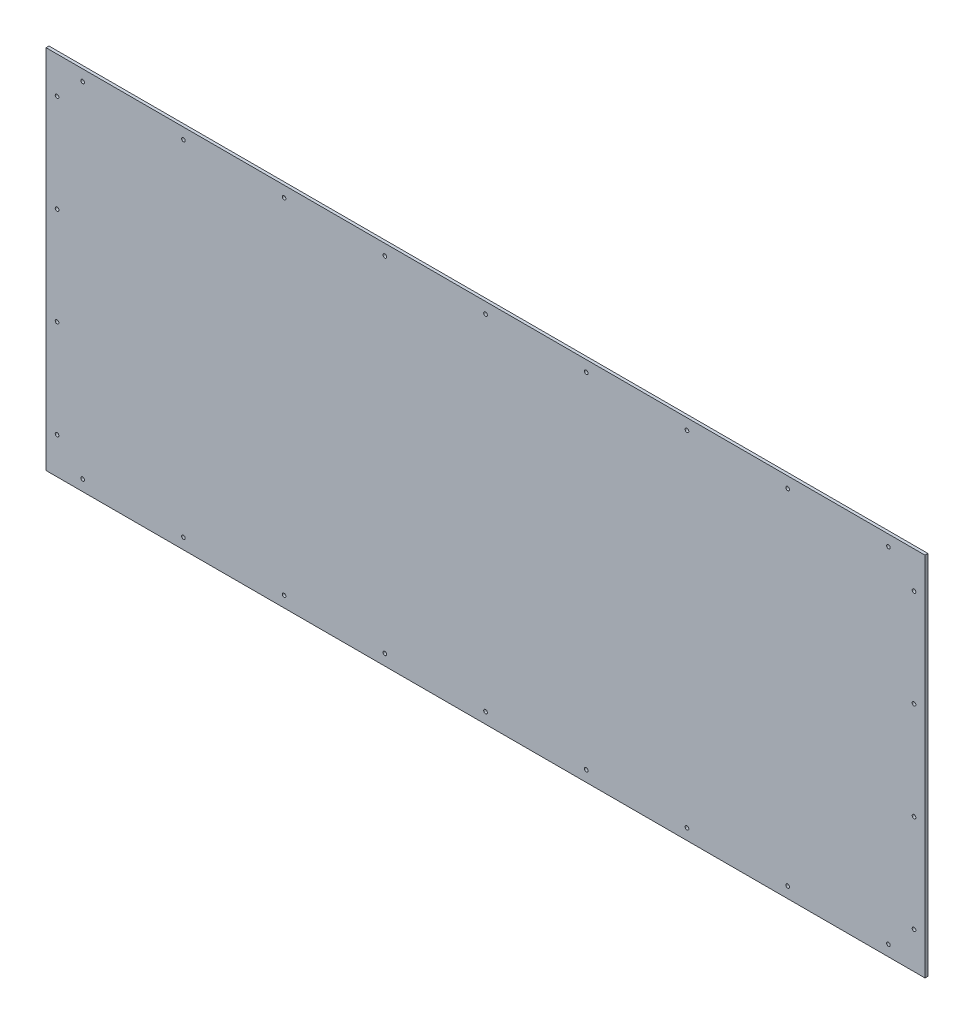
ISO-10303-21;
HEADER;
FILE_DESCRIPTION(('STEP AP214'),'2;1');
FILE_NAME('part.step','',(''),(''),'','','');
FILE_SCHEMA(('AUTOMOTIVE_DESIGN { 1 0 10303 214 1 1 1 1 }'));
ENDSEC;
DATA;
#1=APPLICATION_CONTEXT('core data for automotive mechanical design processes');
#2=APPLICATION_PROTOCOL_DEFINITION('international standard','automotive_design',2000,#1);
#3=PRODUCT_CONTEXT('',#1,'mechanical');
#4=PRODUCT('Part','Part','',(#3));
#5=PRODUCT_RELATED_PRODUCT_CATEGORY('part','',(#4));
#6=PRODUCT_DEFINITION_FORMATION('','',#4);
#7=PRODUCT_DEFINITION_CONTEXT('part definition',#1,'design');
#8=PRODUCT_DEFINITION('design','',#6,#7);
#9=PRODUCT_DEFINITION_SHAPE('','',#8);
#10=(LENGTH_UNIT() NAMED_UNIT(*) SI_UNIT(.MILLI.,.METRE.));
#11=(NAMED_UNIT(*) PLANE_ANGLE_UNIT() SI_UNIT($,.RADIAN.));
#12=(NAMED_UNIT(*) SI_UNIT($,.STERADIAN.) SOLID_ANGLE_UNIT());
#13=UNCERTAINTY_MEASURE_WITH_UNIT(LENGTH_MEASURE(1.E-05),#10,'distance_accuracy_value','');
#14=(GEOMETRIC_REPRESENTATION_CONTEXT(3) GLOBAL_UNCERTAINTY_ASSIGNED_CONTEXT((#13)) GLOBAL_UNIT_ASSIGNED_CONTEXT((#10,
#11,#12)) REPRESENTATION_CONTEXT('',''));
#15=CARTESIAN_POINT('',(0.,0.,0.));
#16=DIRECTION('',(0.,0.,1.));
#17=DIRECTION('',(1.,0.,0.));
#18=AXIS2_PLACEMENT_3D('',#15,#16,#17);
#19=CARTESIAN_POINT('',(300.,-125.,2.));
#20=DIRECTION('',(-1.,0.,0.));
#21=DIRECTION('',(0.,0.,1.));
#22=AXIS2_PLACEMENT_3D('',#19,#20,#21);
#23=PLANE('',#22);
#24=DIRECTION('',(0.,1.,0.));
#25=VECTOR('',#24,1.);
#26=CARTESIAN_POINT('',(300.,-125.,0.));
#27=LINE('',#26,#25);
#28=CARTESIAN_POINT('',(300.,-125.,0.));
#29=VERTEX_POINT('',#28);
#30=CARTESIAN_POINT('',(300.,125.,0.));
#31=VERTEX_POINT('',#30);
#32=EDGE_CURVE('E97',#29,#31,#27,.T.);
#33=ORIENTED_EDGE('',*,*,#32,.T.);
#34=DIRECTION('',(0.,0.,-1.));
#35=VECTOR('',#34,1.);
#36=CARTESIAN_POINT('',(300.,125.,2.));
#37=LINE('',#36,#35);
#38=CARTESIAN_POINT('',(300.,125.,2.));
#39=VERTEX_POINT('',#38);
#40=EDGE_CURVE('E11',#39,#31,#37,.T.);
#41=ORIENTED_EDGE('',*,*,#40,.F.);
#42=DIRECTION('',(0.,1.,0.));
#43=VECTOR('',#42,1.);
#44=CARTESIAN_POINT('',(300.,-125.,2.));
#45=LINE('',#44,#43);
#46=CARTESIAN_POINT('',(300.,-125.,2.));
#47=VERTEX_POINT('',#46);
#48=EDGE_CURVE('E85',#47,#39,#45,.T.);
#49=ORIENTED_EDGE('',*,*,#48,.F.);
#50=DIRECTION('',(0.,0.,-1.));
#51=VECTOR('',#50,1.);
#52=CARTESIAN_POINT('',(300.,-125.,2.));
#53=LINE('',#52,#51);
#54=EDGE_CURVE('E93',#47,#29,#53,.T.);
#55=ORIENTED_EDGE('',*,*,#54,.T.);
#56=EDGE_LOOP('',(#33,#41,#49,#55));
#57=FACE_BOUND('',#56,.T.);
#58=ADVANCED_FACE('F34',(#57),#23,.F.);
#59=CARTESIAN_POINT('',(-300.,125.,2.));
#60=DIRECTION('',(0.,-1.,0.));
#61=DIRECTION('',(0.,0.,-1.));
#62=AXIS2_PLACEMENT_3D('',#59,#60,#61);
#63=PLANE('',#62);
#64=DIRECTION('',(-1.,0.,0.));
#65=VECTOR('',#64,1.);
#66=CARTESIAN_POINT('',(-300.,125.,0.));
#67=LINE('',#66,#65);
#68=CARTESIAN_POINT('',(-300.,125.,0.));
#69=VERTEX_POINT('',#68);
#70=EDGE_CURVE('E89',#31,#69,#67,.T.);
#71=ORIENTED_EDGE('',*,*,#70,.T.);
#72=DIRECTION('',(0.,0.,-1.));
#73=VECTOR('',#72,1.);
#74=CARTESIAN_POINT('',(-300.,125.,2.));
#75=LINE('',#74,#73);
#76=CARTESIAN_POINT('',(-300.,125.,2.));
#77=VERTEX_POINT('',#76);
#78=EDGE_CURVE('E42',#77,#69,#75,.T.);
#79=ORIENTED_EDGE('',*,*,#78,.F.);
#80=DIRECTION('',(-1.,0.,0.));
#81=VECTOR('',#80,1.);
#82=CARTESIAN_POINT('',(-300.,125.,2.));
#83=LINE('',#82,#81);
#84=EDGE_CURVE('E80',#39,#77,#83,.T.);
#85=ORIENTED_EDGE('',*,*,#84,.F.);
#86=ORIENTED_EDGE('',*,*,#40,.T.);
#87=EDGE_LOOP('',(#71,#79,#85,#86));
#88=FACE_BOUND('',#87,.T.);
#89=ADVANCED_FACE('F88',(#88),#63,.F.);
#90=CARTESIAN_POINT('',(-300.,-125.,2.));
#91=DIRECTION('',(1.,0.,0.));
#92=DIRECTION('',(0.,0.,-1.));
#93=AXIS2_PLACEMENT_3D('',#90,#91,#92);
#94=PLANE('',#93);
#95=DIRECTION('',(0.,-1.,0.));
#96=VECTOR('',#95,1.);
#97=CARTESIAN_POINT('',(-300.,-125.,0.));
#98=LINE('',#97,#96);
#99=CARTESIAN_POINT('',(-300.,-125.,0.));
#100=VERTEX_POINT('',#99);
#101=EDGE_CURVE('E67',#69,#100,#98,.T.);
#102=ORIENTED_EDGE('',*,*,#101,.T.);
#103=DIRECTION('',(0.,0.,-1.));
#104=VECTOR('',#103,1.);
#105=CARTESIAN_POINT('',(-300.,-125.,2.));
#106=LINE('',#105,#104);
#107=CARTESIAN_POINT('',(-300.,-125.,2.));
#108=VERTEX_POINT('',#107);
#109=EDGE_CURVE('E90',#108,#100,#106,.T.);
#110=ORIENTED_EDGE('',*,*,#109,.F.);
#111=DIRECTION('',(0.,-1.,0.));
#112=VECTOR('',#111,1.);
#113=CARTESIAN_POINT('',(-300.,-125.,2.));
#114=LINE('',#113,#112);
#115=EDGE_CURVE('E83',#77,#108,#114,.T.);
#116=ORIENTED_EDGE('',*,*,#115,.F.);
#117=ORIENTED_EDGE('',*,*,#78,.T.);
#118=EDGE_LOOP('',(#102,#110,#116,#117));
#119=FACE_BOUND('',#118,.T.);
#120=ADVANCED_FACE('F91',(#119),#94,.F.);
#121=CARTESIAN_POINT('',(-300.,-125.,2.));
#122=DIRECTION('',(0.,1.,0.));
#123=DIRECTION('',(0.,0.,1.));
#124=AXIS2_PLACEMENT_3D('',#121,#122,#123);
#125=PLANE('',#124);
#126=DIRECTION('',(1.,0.,0.));
#127=VECTOR('',#126,1.);
#128=CARTESIAN_POINT('',(-300.,-125.,0.));
#129=LINE('',#128,#127);
#130=EDGE_CURVE('E73',#100,#29,#129,.T.);
#131=ORIENTED_EDGE('',*,*,#130,.T.);
#132=ORIENTED_EDGE('',*,*,#54,.F.);
#133=DIRECTION('',(1.,0.,0.));
#134=VECTOR('',#133,1.);
#135=CARTESIAN_POINT('',(-300.,-125.,2.));
#136=LINE('',#135,#134);
#137=EDGE_CURVE('E50',#108,#47,#136,.T.);
#138=ORIENTED_EDGE('',*,*,#137,.F.);
#139=ORIENTED_EDGE('',*,*,#109,.T.);
#140=EDGE_LOOP('',(#131,#132,#138,#139));
#141=FACE_BOUND('',#140,.T.);
#142=ADVANCED_FACE('F105',(#141),#125,.F.);
#143=CARTESIAN_POINT('',(0.,0.,2.));
#144=DIRECTION('',(0.,0.,-1.));
#145=DIRECTION('',(-1.,0.,0.));
#146=AXIS2_PLACEMENT_3D('',#143,#144,#145);
#147=PLANE('',#146);
#148=CARTESIAN_POINT('',(-275.,-117.5,2.));
#149=DIRECTION('',(0.,0.,1.));
#150=DIRECTION('',(-1.,0.,0.));
#151=AXIS2_PLACEMENT_3D('',#148,#149,#150);
#152=CIRCLE('',#151,1.25000000000006);
#153=CARTESIAN_POINT('',(-276.25,-117.5,2.));
#154=VERTEX_POINT('',#153);
#155=EDGE_CURVE('E120',#154,#154,#152,.T.);
#156=ORIENTED_EDGE('',*,*,#155,.F.);
#157=EDGE_LOOP('',(#156));
#158=FACE_BOUND('',#157,.T.);
#159=CARTESIAN_POINT('',(137.5,-117.5,2.));
#160=DIRECTION('',(0.,0.,1.));
#161=DIRECTION('',(1.,0.,0.));
#162=AXIS2_PLACEMENT_3D('',#159,#160,#161);
#163=CIRCLE('',#162,1.25000000000001);
#164=CARTESIAN_POINT('',(138.75,-117.5,2.));
#165=VERTEX_POINT('',#164);
#166=EDGE_CURVE('E141',#165,#165,#163,.T.);
#167=ORIENTED_EDGE('',*,*,#166,.F.);
#168=EDGE_LOOP('',(#167));
#169=FACE_BOUND('',#168,.T.);
#170=CARTESIAN_POINT('',(206.25,-117.5,2.));
#171=DIRECTION('',(0.,0.,1.));
#172=DIRECTION('',(1.,0.,0.));
#173=AXIS2_PLACEMENT_3D('',#170,#171,#172);
#174=CIRCLE('',#173,1.25000000000001);
#175=CARTESIAN_POINT('',(207.5,-117.5,2.));
#176=VERTEX_POINT('',#175);
#177=EDGE_CURVE('E128',#176,#176,#174,.T.);
#178=ORIENTED_EDGE('',*,*,#177,.F.);
#179=EDGE_LOOP('',(#178));
#180=FACE_BOUND('',#179,.T.);
#181=CARTESIAN_POINT('',(275.,-117.5,2.));
#182=DIRECTION('',(0.,0.,1.));
#183=DIRECTION('',(1.,0.,0.));
#184=AXIS2_PLACEMENT_3D('',#181,#182,#183);
#185=CIRCLE('',#184,1.24999999999996);
#186=CARTESIAN_POINT('',(276.25,-117.5,2.));
#187=VERTEX_POINT('',#186);
#188=EDGE_CURVE('E127',#187,#187,#185,.T.);
#189=ORIENTED_EDGE('',*,*,#188,.F.);
#190=EDGE_LOOP('',(#189));
#191=FACE_BOUND('',#190,.T.);
#192=CARTESIAN_POINT('',(1.38777878078145E-13,-117.5,2.));
#193=DIRECTION('',(0.,0.,1.));
#194=DIRECTION('',(-1.,0.,0.));
#195=AXIS2_PLACEMENT_3D('',#192,#193,#194);
#196=CIRCLE('',#195,1.25);
#197=CARTESIAN_POINT('',(-1.24999999999987,-117.5,2.));
#198=VERTEX_POINT('',#197);
#199=EDGE_CURVE('E134',#198,#198,#196,.T.);
#200=ORIENTED_EDGE('',*,*,#199,.F.);
#201=EDGE_LOOP('',(#200));
#202=FACE_BOUND('',#201,.T.);
#203=CARTESIAN_POINT('',(68.7500000000001,-117.5,2.));
#204=DIRECTION('',(0.,0.,1.));
#205=DIRECTION('',(1.,0.,0.));
#206=AXIS2_PLACEMENT_3D('',#203,#204,#205);
#207=CIRCLE('',#206,1.25);
#208=CARTESIAN_POINT('',(70.0000000000001,-117.5,2.));
#209=VERTEX_POINT('',#208);
#210=EDGE_CURVE('E142',#209,#209,#207,.T.);
#211=ORIENTED_EDGE('',*,*,#210,.F.);
#212=EDGE_LOOP('',(#211));
#213=FACE_BOUND('',#212,.T.);
#214=CARTESIAN_POINT('',(-68.7499999999999,-117.5,2.));
#215=DIRECTION('',(0.,0.,1.));
#216=DIRECTION('',(-1.,0.,0.));
#217=AXIS2_PLACEMENT_3D('',#214,#215,#216);
#218=CIRCLE('',#217,1.25);
#219=CARTESIAN_POINT('',(-69.9999999999999,-117.5,2.));
#220=VERTEX_POINT('',#219);
#221=EDGE_CURVE('E164',#220,#220,#218,.T.);
#222=ORIENTED_EDGE('',*,*,#221,.F.);
#223=EDGE_LOOP('',(#222));
#224=FACE_BOUND('',#223,.T.);
#225=CARTESIAN_POINT('',(-137.5,-117.5,2.));
#226=DIRECTION('',(0.,0.,1.));
#227=DIRECTION('',(-1.,0.,0.));
#228=AXIS2_PLACEMENT_3D('',#225,#226,#227);
#229=CIRCLE('',#228,1.25000000000001);
#230=CARTESIAN_POINT('',(-138.75,-117.5,2.));
#231=VERTEX_POINT('',#230);
#232=EDGE_CURVE('E158',#231,#231,#229,.T.);
#233=ORIENTED_EDGE('',*,*,#232,.F.);
#234=EDGE_LOOP('',(#233));
#235=FACE_BOUND('',#234,.T.);
#236=CARTESIAN_POINT('',(-206.25,-117.5,2.));
#237=DIRECTION('',(0.,0.,1.));
#238=DIRECTION('',(-1.,0.,0.));
#239=AXIS2_PLACEMENT_3D('',#236,#237,#238);
#240=CIRCLE('',#239,1.25000000000001);
#241=CARTESIAN_POINT('',(-207.5,-117.5,2.));
#242=VERTEX_POINT('',#241);
#243=EDGE_CURVE('E152',#242,#242,#240,.T.);
#244=ORIENTED_EDGE('',*,*,#243,.F.);
#245=EDGE_LOOP('',(#244));
#246=FACE_BOUND('',#245,.T.);
#247=CARTESIAN_POINT('',(-275.,117.5,2.));
#248=DIRECTION('',(0.,0.,1.));
#249=DIRECTION('',(1.,0.,0.));
#250=AXIS2_PLACEMENT_3D('',#247,#248,#249);
#251=CIRCLE('',#250,1.25000000000006);
#252=CARTESIAN_POINT('',(-273.75,117.5,2.));
#253=VERTEX_POINT('',#252);
#254=EDGE_CURVE('E199',#253,#253,#251,.T.);
#255=ORIENTED_EDGE('',*,*,#254,.F.);
#256=EDGE_LOOP('',(#255));
#257=FACE_BOUND('',#256,.T.);
#258=CARTESIAN_POINT('',(292.5,99.9999999999993,2.));
#259=DIRECTION('',(0.,0.,1.));
#260=DIRECTION('',(-1.,0.,0.));
#261=AXIS2_PLACEMENT_3D('',#258,#259,#260);
#262=CIRCLE('',#261,1.24999999999996);
#263=CARTESIAN_POINT('',(291.25,99.9999999999993,2.));
#264=VERTEX_POINT('',#263);
#265=EDGE_CURVE('E206',#264,#264,#262,.T.);
#266=ORIENTED_EDGE('',*,*,#265,.F.);
#267=EDGE_LOOP('',(#266));
#268=FACE_BOUND('',#267,.T.);
#269=CARTESIAN_POINT('',(292.499999999999,-100.000000000001,2.));
#270=DIRECTION('',(0.,0.,1.));
#271=DIRECTION('',(1.,0.,0.));
#272=AXIS2_PLACEMENT_3D('',#269,#270,#271);
#273=CIRCLE('',#272,1.24999999999996);
#274=CARTESIAN_POINT('',(293.749999999999,-100.000000000001,2.));
#275=VERTEX_POINT('',#274);
#276=EDGE_CURVE('E212',#275,#275,#273,.T.);
#277=ORIENTED_EDGE('',*,*,#276,.F.);
#278=EDGE_LOOP('',(#277));
#279=FACE_BOUND('',#278,.T.);
#280=CARTESIAN_POINT('',(292.5,33.3333333333326,2.));
#281=DIRECTION('',(0.,0.,1.));
#282=DIRECTION('',(-1.,0.,0.));
#283=AXIS2_PLACEMENT_3D('',#280,#281,#282);
#284=CIRCLE('',#283,1.25000000000001);
#285=CARTESIAN_POINT('',(291.25,33.3333333333326,2.));
#286=VERTEX_POINT('',#285);
#287=EDGE_CURVE('E176',#286,#286,#284,.T.);
#288=ORIENTED_EDGE('',*,*,#287,.F.);
#289=EDGE_LOOP('',(#288));
#290=FACE_BOUND('',#289,.T.);
#291=CARTESIAN_POINT('',(292.499999999999,-33.333333333334,2.));
#292=DIRECTION('',(0.,0.,1.));
#293=DIRECTION('',(-1.,0.,0.));
#294=AXIS2_PLACEMENT_3D('',#291,#292,#293);
#295=CIRCLE('',#294,1.25000000000001);
#296=CARTESIAN_POINT('',(291.249999999999,-33.333333333334,2.));
#297=VERTEX_POINT('',#296);
#298=EDGE_CURVE('E175',#297,#297,#295,.T.);
#299=ORIENTED_EDGE('',*,*,#298,.F.);
#300=EDGE_LOOP('',(#299));
#301=FACE_BOUND('',#300,.T.);
#302=CARTESIAN_POINT('',(-292.5,-33.3333333333333,2.));
#303=DIRECTION('',(0.,0.,1.));
#304=DIRECTION('',(1.,0.,0.));
#305=AXIS2_PLACEMENT_3D('',#302,#303,#304);
#306=CIRCLE('',#305,1.25000000000001);
#307=CARTESIAN_POINT('',(-291.25,-33.3333333333333,2.));
#308=VERTEX_POINT('',#307);
#309=EDGE_CURVE('E182',#308,#308,#306,.T.);
#310=ORIENTED_EDGE('',*,*,#309,.F.);
#311=EDGE_LOOP('',(#310));
#312=FACE_BOUND('',#311,.T.);
#313=CARTESIAN_POINT('',(-292.5,33.3333333333333,2.));
#314=DIRECTION('',(0.,0.,1.));
#315=DIRECTION('',(1.,0.,0.));
#316=AXIS2_PLACEMENT_3D('',#313,#314,#315);
#317=CIRCLE('',#316,1.25000000000001);
#318=CARTESIAN_POINT('',(-291.25,33.3333333333333,2.));
#319=VERTEX_POINT('',#318);
#320=EDGE_CURVE('E188',#319,#319,#317,.T.);
#321=ORIENTED_EDGE('',*,*,#320,.F.);
#322=EDGE_LOOP('',(#321));
#323=FACE_BOUND('',#322,.T.);
#324=CARTESIAN_POINT('',(-292.5,100.,2.));
#325=DIRECTION('',(0.,0.,1.));
#326=DIRECTION('',(1.,0.,0.));
#327=AXIS2_PLACEMENT_3D('',#324,#325,#326);
#328=CIRCLE('',#327,1.24999999999996);
#329=CARTESIAN_POINT('',(-291.25,100.,2.));
#330=VERTEX_POINT('',#329);
#331=EDGE_CURVE('E114',#330,#330,#328,.T.);
#332=ORIENTED_EDGE('',*,*,#331,.F.);
#333=EDGE_LOOP('',(#332));
#334=FACE_BOUND('',#333,.T.);
#335=CARTESIAN_POINT('',(137.5,117.5,2.));
#336=DIRECTION('',(0.,0.,1.));
#337=DIRECTION('',(-1.,0.,0.));
#338=AXIS2_PLACEMENT_3D('',#335,#336,#337);
#339=CIRCLE('',#338,1.25000000000001);
#340=CARTESIAN_POINT('',(136.25,117.5,2.));
#341=VERTEX_POINT('',#340);
#342=EDGE_CURVE('E224',#341,#341,#339,.T.);
#343=ORIENTED_EDGE('',*,*,#342,.F.);
#344=EDGE_LOOP('',(#343));
#345=FACE_BOUND('',#344,.T.);
#346=CARTESIAN_POINT('',(206.25,117.5,2.));
#347=DIRECTION('',(0.,0.,1.));
#348=DIRECTION('',(-1.,0.,0.));
#349=AXIS2_PLACEMENT_3D('',#346,#347,#348);
#350=CIRCLE('',#349,1.25000000000001);
#351=CARTESIAN_POINT('',(205.,117.5,2.));
#352=VERTEX_POINT('',#351);
#353=EDGE_CURVE('E247',#352,#352,#350,.T.);
#354=ORIENTED_EDGE('',*,*,#353,.F.);
#355=EDGE_LOOP('',(#354));
#356=FACE_BOUND('',#355,.T.);
#357=CARTESIAN_POINT('',(275.,117.5,2.));
#358=DIRECTION('',(0.,0.,1.));
#359=DIRECTION('',(-1.,0.,0.));
#360=AXIS2_PLACEMENT_3D('',#357,#358,#359);
#361=CIRCLE('',#360,1.24999999999996);
#362=CARTESIAN_POINT('',(273.75,117.5,2.));
#363=VERTEX_POINT('',#362);
#364=EDGE_CURVE('E248',#363,#363,#361,.T.);
#365=ORIENTED_EDGE('',*,*,#364,.F.);
#366=EDGE_LOOP('',(#365));
#367=FACE_BOUND('',#366,.T.);
#368=CARTESIAN_POINT('',(1.38777878078145E-13,117.5,2.));
#369=DIRECTION('',(0.,0.,1.));
#370=DIRECTION('',(1.,0.,0.));
#371=AXIS2_PLACEMENT_3D('',#368,#369,#370);
#372=CIRCLE('',#371,1.25);
#373=CARTESIAN_POINT('',(1.25000000000014,117.5,2.));
#374=VERTEX_POINT('',#373);
#375=EDGE_CURVE('E258',#374,#374,#372,.T.);
#376=ORIENTED_EDGE('',*,*,#375,.F.);
#377=EDGE_LOOP('',(#376));
#378=FACE_BOUND('',#377,.T.);
#379=CARTESIAN_POINT('',(68.7500000000001,117.5,2.));
#380=DIRECTION('',(0.,0.,1.));
#381=DIRECTION('',(-1.,0.,0.));
#382=AXIS2_PLACEMENT_3D('',#379,#380,#381);
#383=CIRCLE('',#382,1.25);
#384=CARTESIAN_POINT('',(67.5000000000001,117.5,2.));
#385=VERTEX_POINT('',#384);
#386=EDGE_CURVE('E223',#385,#385,#383,.T.);
#387=ORIENTED_EDGE('',*,*,#386,.F.);
#388=EDGE_LOOP('',(#387));
#389=FACE_BOUND('',#388,.T.);
#390=CARTESIAN_POINT('',(-68.7499999999999,117.5,2.));
#391=DIRECTION('',(0.,0.,1.));
#392=DIRECTION('',(1.,0.,0.));
#393=AXIS2_PLACEMENT_3D('',#390,#391,#392);
#394=CIRCLE('',#393,1.25);
#395=CARTESIAN_POINT('',(-67.4999999999999,117.5,2.));
#396=VERTEX_POINT('',#395);
#397=EDGE_CURVE('E230',#396,#396,#394,.T.);
#398=ORIENTED_EDGE('',*,*,#397,.F.);
#399=EDGE_LOOP('',(#398));
#400=FACE_BOUND('',#399,.T.);
#401=CARTESIAN_POINT('',(-137.5,117.5,2.));
#402=DIRECTION('',(0.,0.,1.));
#403=DIRECTION('',(1.,0.,0.));
#404=AXIS2_PLACEMENT_3D('',#401,#402,#403);
#405=CIRCLE('',#404,1.25000000000001);
#406=CARTESIAN_POINT('',(-136.25,117.5,2.));
#407=VERTEX_POINT('',#406);
#408=EDGE_CURVE('E236',#407,#407,#405,.T.);
#409=ORIENTED_EDGE('',*,*,#408,.F.);
#410=EDGE_LOOP('',(#409));
#411=FACE_BOUND('',#410,.T.);
#412=CARTESIAN_POINT('',(-206.25,117.5,2.));
#413=DIRECTION('',(0.,0.,1.));
#414=DIRECTION('',(1.,0.,0.));
#415=AXIS2_PLACEMENT_3D('',#412,#413,#414);
#416=CIRCLE('',#415,1.25000000000001);
#417=CARTESIAN_POINT('',(-205.,117.5,2.));
#418=VERTEX_POINT('',#417);
#419=EDGE_CURVE('E200',#418,#418,#416,.T.);
#420=ORIENTED_EDGE('',*,*,#419,.F.);
#421=EDGE_LOOP('',(#420));
#422=FACE_BOUND('',#421,.T.);
#423=CARTESIAN_POINT('',(-292.5,-100.,2.));
#424=DIRECTION('',(0.,0.,1.));
#425=DIRECTION('',(-1.,0.,0.));
#426=AXIS2_PLACEMENT_3D('',#423,#424,#425);
#427=CIRCLE('',#426,1.24999999999996);
#428=CARTESIAN_POINT('',(-293.75,-100.,2.));
#429=VERTEX_POINT('',#428);
#430=EDGE_CURVE('E100',#429,#429,#427,.T.);
#431=ORIENTED_EDGE('',*,*,#430,.F.);
#432=EDGE_LOOP('',(#431));
#433=FACE_BOUND('',#432,.T.);
#434=ORIENTED_EDGE('',*,*,#48,.T.);
#435=ORIENTED_EDGE('',*,*,#84,.T.);
#436=ORIENTED_EDGE('',*,*,#115,.T.);
#437=ORIENTED_EDGE('',*,*,#137,.T.);
#438=EDGE_LOOP('',(#434,#435,#436,#437));
#439=FACE_BOUND('',#438,.T.);
#440=ADVANCED_FACE('F81',(#158,#169,#180,#191,#202,#213,#224,#235,#246,#257,#268,#279,#290,#301,
#312,#323,#334,#345,#356,#367,#378,#389,#400,#411,#422,#433,#439),#147,.F.);
#441=CARTESIAN_POINT('',(0.,0.,0.));
#442=DIRECTION('',(0.,0.,-1.));
#443=DIRECTION('',(-1.,0.,0.));
#444=AXIS2_PLACEMENT_3D('',#441,#442,#443);
#445=PLANE('',#444);
#446=CARTESIAN_POINT('',(-275.,-117.5,0.));
#447=DIRECTION('',(0.,0.,1.));
#448=DIRECTION('',(-1.,0.,0.));
#449=AXIS2_PLACEMENT_3D('',#446,#447,#448);
#450=CIRCLE('',#449,1.25000000000006);
#451=CARTESIAN_POINT('',(-276.25,-117.5,0.));
#452=VERTEX_POINT('',#451);
#453=EDGE_CURVE('E117',#452,#452,#450,.T.);
#454=ORIENTED_EDGE('',*,*,#453,.T.);
#455=EDGE_LOOP('',(#454));
#456=FACE_BOUND('',#455,.T.);
#457=CARTESIAN_POINT('',(137.5,-117.5,0.));
#458=DIRECTION('',(0.,0.,1.));
#459=DIRECTION('',(1.,0.,0.));
#460=AXIS2_PLACEMENT_3D('',#457,#458,#459);
#461=CIRCLE('',#460,1.25000000000001);
#462=CARTESIAN_POINT('',(138.75,-117.5,0.));
#463=VERTEX_POINT('',#462);
#464=EDGE_CURVE('E138',#463,#463,#461,.T.);
#465=ORIENTED_EDGE('',*,*,#464,.T.);
#466=EDGE_LOOP('',(#465));
#467=FACE_BOUND('',#466,.T.);
#468=CARTESIAN_POINT('',(206.25,-117.5,0.));
#469=DIRECTION('',(0.,0.,1.));
#470=DIRECTION('',(1.,0.,0.));
#471=AXIS2_PLACEMENT_3D('',#468,#469,#470);
#472=CIRCLE('',#471,1.25000000000001);
#473=CARTESIAN_POINT('',(207.5,-117.5,0.));
#474=VERTEX_POINT('',#473);
#475=EDGE_CURVE('E145',#474,#474,#472,.T.);
#476=ORIENTED_EDGE('',*,*,#475,.T.);
#477=EDGE_LOOP('',(#476));
#478=FACE_BOUND('',#477,.T.);
#479=CARTESIAN_POINT('',(275.,-117.5,0.));
#480=DIRECTION('',(0.,0.,1.));
#481=DIRECTION('',(1.,0.,0.));
#482=AXIS2_PLACEMENT_3D('',#479,#480,#481);
#483=CIRCLE('',#482,1.24999999999996);
#484=CARTESIAN_POINT('',(276.25,-117.5,0.));
#485=VERTEX_POINT('',#484);
#486=EDGE_CURVE('E124',#485,#485,#483,.T.);
#487=ORIENTED_EDGE('',*,*,#486,.T.);
#488=EDGE_LOOP('',(#487));
#489=FACE_BOUND('',#488,.T.);
#490=CARTESIAN_POINT('',(1.38777878078145E-13,-117.5,0.));
#491=DIRECTION('',(0.,0.,1.));
#492=DIRECTION('',(-1.,0.,0.));
#493=AXIS2_PLACEMENT_3D('',#490,#491,#492);
#494=CIRCLE('',#493,1.25);
#495=CARTESIAN_POINT('',(-1.24999999999987,-117.5,0.));
#496=VERTEX_POINT('',#495);
#497=EDGE_CURVE('E131',#496,#496,#494,.T.);
#498=ORIENTED_EDGE('',*,*,#497,.T.);
#499=EDGE_LOOP('',(#498));
#500=FACE_BOUND('',#499,.T.);
#501=CARTESIAN_POINT('',(68.7500000000001,-117.5,0.));
#502=DIRECTION('',(0.,0.,1.));
#503=DIRECTION('',(1.,0.,0.));
#504=AXIS2_PLACEMENT_3D('',#501,#502,#503);
#505=CIRCLE('',#504,1.25);
#506=CARTESIAN_POINT('',(70.0000000000001,-117.5,0.));
#507=VERTEX_POINT('',#506);
#508=EDGE_CURVE('E167',#507,#507,#505,.T.);
#509=ORIENTED_EDGE('',*,*,#508,.T.);
#510=EDGE_LOOP('',(#509));
#511=FACE_BOUND('',#510,.T.);
#512=CARTESIAN_POINT('',(-68.7499999999999,-117.5,0.));
#513=DIRECTION('',(0.,0.,1.));
#514=DIRECTION('',(-1.,0.,0.));
#515=AXIS2_PLACEMENT_3D('',#512,#513,#514);
#516=CIRCLE('',#515,1.25);
#517=CARTESIAN_POINT('',(-69.9999999999999,-117.5,0.));
#518=VERTEX_POINT('',#517);
#519=EDGE_CURVE('E161',#518,#518,#516,.T.);
#520=ORIENTED_EDGE('',*,*,#519,.T.);
#521=EDGE_LOOP('',(#520));
#522=FACE_BOUND('',#521,.T.);
#523=CARTESIAN_POINT('',(-137.5,-117.5,0.));
#524=DIRECTION('',(0.,0.,1.));
#525=DIRECTION('',(-1.,0.,0.));
#526=AXIS2_PLACEMENT_3D('',#523,#524,#525);
#527=CIRCLE('',#526,1.25000000000001);
#528=CARTESIAN_POINT('',(-138.75,-117.5,0.));
#529=VERTEX_POINT('',#528);
#530=EDGE_CURVE('E155',#529,#529,#527,.T.);
#531=ORIENTED_EDGE('',*,*,#530,.T.);
#532=EDGE_LOOP('',(#531));
#533=FACE_BOUND('',#532,.T.);
#534=CARTESIAN_POINT('',(-206.25,-117.5,0.));
#535=DIRECTION('',(0.,0.,1.));
#536=DIRECTION('',(-1.,0.,0.));
#537=AXIS2_PLACEMENT_3D('',#534,#535,#536);
#538=CIRCLE('',#537,1.25000000000001);
#539=CARTESIAN_POINT('',(-207.5,-117.5,0.));
#540=VERTEX_POINT('',#539);
#541=EDGE_CURVE('E123',#540,#540,#538,.T.);
#542=ORIENTED_EDGE('',*,*,#541,.T.);
#543=EDGE_LOOP('',(#542));
#544=FACE_BOUND('',#543,.T.);
#545=CARTESIAN_POINT('',(-275.,117.5,0.));
#546=DIRECTION('',(0.,0.,1.));
#547=DIRECTION('',(1.,0.,0.));
#548=AXIS2_PLACEMENT_3D('',#545,#546,#547);
#549=CIRCLE('',#548,1.25000000000006);
#550=CARTESIAN_POINT('',(-273.75,117.5,0.));
#551=VERTEX_POINT('',#550);
#552=EDGE_CURVE('E196',#551,#551,#549,.T.);
#553=ORIENTED_EDGE('',*,*,#552,.T.);
#554=EDGE_LOOP('',(#553));
#555=FACE_BOUND('',#554,.T.);
#556=CARTESIAN_POINT('',(292.5,99.9999999999993,0.));
#557=DIRECTION('',(0.,0.,1.));
#558=DIRECTION('',(-1.,0.,0.));
#559=AXIS2_PLACEMENT_3D('',#556,#557,#558);
#560=CIRCLE('',#559,1.24999999999996);
#561=CARTESIAN_POINT('',(291.25,99.9999999999993,0.));
#562=VERTEX_POINT('',#561);
#563=EDGE_CURVE('E203',#562,#562,#560,.T.);
#564=ORIENTED_EDGE('',*,*,#563,.T.);
#565=EDGE_LOOP('',(#564));
#566=FACE_BOUND('',#565,.T.);
#567=CARTESIAN_POINT('',(292.499999999999,-100.000000000001,0.));
#568=DIRECTION('',(0.,0.,1.));
#569=DIRECTION('',(1.,0.,0.));
#570=AXIS2_PLACEMENT_3D('',#567,#568,#569);
#571=CIRCLE('',#570,1.24999999999996);
#572=CARTESIAN_POINT('',(293.749999999999,-100.000000000001,0.));
#573=VERTEX_POINT('',#572);
#574=EDGE_CURVE('E209',#573,#573,#571,.T.);
#575=ORIENTED_EDGE('',*,*,#574,.T.);
#576=EDGE_LOOP('',(#575));
#577=FACE_BOUND('',#576,.T.);
#578=CARTESIAN_POINT('',(292.5,33.3333333333326,0.));
#579=DIRECTION('',(0.,0.,1.));
#580=DIRECTION('',(-1.,0.,0.));
#581=AXIS2_PLACEMENT_3D('',#578,#579,#580);
#582=CIRCLE('',#581,1.25000000000001);
#583=CARTESIAN_POINT('',(291.25,33.3333333333326,0.));
#584=VERTEX_POINT('',#583);
#585=EDGE_CURVE('E215',#584,#584,#582,.T.);
#586=ORIENTED_EDGE('',*,*,#585,.T.);
#587=EDGE_LOOP('',(#586));
#588=FACE_BOUND('',#587,.T.);
#589=CARTESIAN_POINT('',(292.499999999999,-33.333333333334,0.));
#590=DIRECTION('',(0.,0.,1.));
#591=DIRECTION('',(-1.,0.,0.));
#592=AXIS2_PLACEMENT_3D('',#589,#590,#591);
#593=CIRCLE('',#592,1.25000000000001);
#594=CARTESIAN_POINT('',(291.249999999999,-33.333333333334,0.));
#595=VERTEX_POINT('',#594);
#596=EDGE_CURVE('E172',#595,#595,#593,.T.);
#597=ORIENTED_EDGE('',*,*,#596,.T.);
#598=EDGE_LOOP('',(#597));
#599=FACE_BOUND('',#598,.T.);
#600=CARTESIAN_POINT('',(-292.5,-33.3333333333333,0.));
#601=DIRECTION('',(0.,0.,1.));
#602=DIRECTION('',(1.,0.,0.));
#603=AXIS2_PLACEMENT_3D('',#600,#601,#602);
#604=CIRCLE('',#603,1.25000000000001);
#605=CARTESIAN_POINT('',(-291.25,-33.3333333333333,0.));
#606=VERTEX_POINT('',#605);
#607=EDGE_CURVE('E179',#606,#606,#604,.T.);
#608=ORIENTED_EDGE('',*,*,#607,.T.);
#609=EDGE_LOOP('',(#608));
#610=FACE_BOUND('',#609,.T.);
#611=CARTESIAN_POINT('',(-292.5,33.3333333333333,0.));
#612=DIRECTION('',(0.,0.,1.));
#613=DIRECTION('',(1.,0.,0.));
#614=AXIS2_PLACEMENT_3D('',#611,#612,#613);
#615=CIRCLE('',#614,1.25000000000001);
#616=CARTESIAN_POINT('',(-291.25,33.3333333333333,0.));
#617=VERTEX_POINT('',#616);
#618=EDGE_CURVE('E185',#617,#617,#615,.T.);
#619=ORIENTED_EDGE('',*,*,#618,.T.);
#620=EDGE_LOOP('',(#619));
#621=FACE_BOUND('',#620,.T.);
#622=CARTESIAN_POINT('',(-292.5,100.,0.));
#623=DIRECTION('',(0.,0.,1.));
#624=DIRECTION('',(1.,0.,0.));
#625=AXIS2_PLACEMENT_3D('',#622,#623,#624);
#626=CIRCLE('',#625,1.24999999999996);
#627=CARTESIAN_POINT('',(-291.25,100.,0.));
#628=VERTEX_POINT('',#627);
#629=EDGE_CURVE('E191',#628,#628,#626,.T.);
#630=ORIENTED_EDGE('',*,*,#629,.T.);
#631=EDGE_LOOP('',(#630));
#632=FACE_BOUND('',#631,.T.);
#633=CARTESIAN_POINT('',(137.5,117.5,0.));
#634=DIRECTION('',(0.,0.,1.));
#635=DIRECTION('',(-1.,0.,0.));
#636=AXIS2_PLACEMENT_3D('',#633,#634,#635);
#637=CIRCLE('',#636,1.25000000000001);
#638=CARTESIAN_POINT('',(136.25,117.5,0.));
#639=VERTEX_POINT('',#638);
#640=EDGE_CURVE('E251',#639,#639,#637,.T.);
#641=ORIENTED_EDGE('',*,*,#640,.T.);
#642=EDGE_LOOP('',(#641));
#643=FACE_BOUND('',#642,.T.);
#644=CARTESIAN_POINT('',(206.25,117.5,0.));
#645=DIRECTION('',(0.,0.,1.));
#646=DIRECTION('',(-1.,0.,0.));
#647=AXIS2_PLACEMENT_3D('',#644,#645,#646);
#648=CIRCLE('',#647,1.25000000000001);
#649=CARTESIAN_POINT('',(205.,117.5,0.));
#650=VERTEX_POINT('',#649);
#651=EDGE_CURVE('E244',#650,#650,#648,.T.);
#652=ORIENTED_EDGE('',*,*,#651,.T.);
#653=EDGE_LOOP('',(#652));
#654=FACE_BOUND('',#653,.T.);
#655=CARTESIAN_POINT('',(275.,117.5,0.));
#656=DIRECTION('',(0.,0.,1.));
#657=DIRECTION('',(-1.,0.,0.));
#658=AXIS2_PLACEMENT_3D('',#655,#656,#657);
#659=CIRCLE('',#658,1.24999999999996);
#660=CARTESIAN_POINT('',(273.75,117.5,0.));
#661=VERTEX_POINT('',#660);
#662=EDGE_CURVE('E261',#661,#661,#659,.T.);
#663=ORIENTED_EDGE('',*,*,#662,.T.);
#664=EDGE_LOOP('',(#663));
#665=FACE_BOUND('',#664,.T.);
#666=CARTESIAN_POINT('',(1.38777878078145E-13,117.5,0.));
#667=DIRECTION('',(0.,0.,1.));
#668=DIRECTION('',(1.,0.,0.));
#669=AXIS2_PLACEMENT_3D('',#666,#667,#668);
#670=CIRCLE('',#669,1.25);
#671=CARTESIAN_POINT('',(1.25000000000014,117.5,0.));
#672=VERTEX_POINT('',#671);
#673=EDGE_CURVE('E137',#672,#672,#670,.T.);
#674=ORIENTED_EDGE('',*,*,#673,.T.);
#675=EDGE_LOOP('',(#674));
#676=FACE_BOUND('',#675,.T.);
#677=CARTESIAN_POINT('',(68.7500000000001,117.5,0.));
#678=DIRECTION('',(0.,0.,1.));
#679=DIRECTION('',(-1.,0.,0.));
#680=AXIS2_PLACEMENT_3D('',#677,#678,#679);
#681=CIRCLE('',#680,1.25);
#682=CARTESIAN_POINT('',(67.5000000000001,117.5,0.));
#683=VERTEX_POINT('',#682);
#684=EDGE_CURVE('E220',#683,#683,#681,.T.);
#685=ORIENTED_EDGE('',*,*,#684,.T.);
#686=EDGE_LOOP('',(#685));
#687=FACE_BOUND('',#686,.T.);
#688=CARTESIAN_POINT('',(-68.7499999999999,117.5,0.));
#689=DIRECTION('',(0.,0.,1.));
#690=DIRECTION('',(1.,0.,0.));
#691=AXIS2_PLACEMENT_3D('',#688,#689,#690);
#692=CIRCLE('',#691,1.25);
#693=CARTESIAN_POINT('',(-67.4999999999999,117.5,0.));
#694=VERTEX_POINT('',#693);
#695=EDGE_CURVE('E227',#694,#694,#692,.T.);
#696=ORIENTED_EDGE('',*,*,#695,.T.);
#697=EDGE_LOOP('',(#696));
#698=FACE_BOUND('',#697,.T.);
#699=CARTESIAN_POINT('',(-137.5,117.5,0.));
#700=DIRECTION('',(0.,0.,1.));
#701=DIRECTION('',(1.,0.,0.));
#702=AXIS2_PLACEMENT_3D('',#699,#700,#701);
#703=CIRCLE('',#702,1.25000000000001);
#704=CARTESIAN_POINT('',(-136.25,117.5,0.));
#705=VERTEX_POINT('',#704);
#706=EDGE_CURVE('E233',#705,#705,#703,.T.);
#707=ORIENTED_EDGE('',*,*,#706,.T.);
#708=EDGE_LOOP('',(#707));
#709=FACE_BOUND('',#708,.T.);
#710=CARTESIAN_POINT('',(-206.25,117.5,0.));
#711=DIRECTION('',(0.,0.,1.));
#712=DIRECTION('',(1.,0.,0.));
#713=AXIS2_PLACEMENT_3D('',#710,#711,#712);
#714=CIRCLE('',#713,1.25000000000001);
#715=CARTESIAN_POINT('',(-205.,117.5,0.));
#716=VERTEX_POINT('',#715);
#717=EDGE_CURVE('E239',#716,#716,#714,.T.);
#718=ORIENTED_EDGE('',*,*,#717,.T.);
#719=EDGE_LOOP('',(#718));
#720=FACE_BOUND('',#719,.T.);
#721=CARTESIAN_POINT('',(-292.5,-100.,0.));
#722=DIRECTION('',(0.,0.,1.));
#723=DIRECTION('',(-1.,0.,0.));
#724=AXIS2_PLACEMENT_3D('',#721,#722,#723);
#725=CIRCLE('',#724,1.24999999999996);
#726=CARTESIAN_POINT('',(-293.75,-100.,0.));
#727=VERTEX_POINT('',#726);
#728=EDGE_CURVE('E111',#727,#727,#725,.T.);
#729=ORIENTED_EDGE('',*,*,#728,.T.);
#730=EDGE_LOOP('',(#729));
#731=FACE_BOUND('',#730,.T.);
#732=ORIENTED_EDGE('',*,*,#32,.F.);
#733=ORIENTED_EDGE('',*,*,#130,.F.);
#734=ORIENTED_EDGE('',*,*,#101,.F.);
#735=ORIENTED_EDGE('',*,*,#70,.F.);
#736=EDGE_LOOP('',(#732,#733,#734,#735));
#737=FACE_BOUND('',#736,.T.);
#738=ADVANCED_FACE('F108',(#456,#467,#478,#489,#500,#511,#522,#533,#544,#555,#566,#577,#588,
#599,#610,#621,#632,#643,#654,#665,#676,#687,#698,#709,#720,#731,#737),#445,.T.);
#739=CARTESIAN_POINT('',(-292.5,-100.,2.));
#740=DIRECTION('',(0.,0.,-1.));
#741=DIRECTION('',(-1.,0.,0.));
#742=AXIS2_PLACEMENT_3D('',#739,#740,#741);
#743=CYLINDRICAL_SURFACE('',#742,1.24999999999996);
#744=ORIENTED_EDGE('',*,*,#430,.T.);
#745=EDGE_LOOP('',(#744));
#746=FACE_BOUND('',#745,.T.);
#747=ORIENTED_EDGE('',*,*,#728,.F.);
#748=EDGE_LOOP('',(#747));
#749=FACE_BOUND('',#748,.T.);
#750=ADVANCED_FACE('F286',(#746,#749),#743,.F.);
#751=CARTESIAN_POINT('',(-206.25,117.5,2.));
#752=DIRECTION('',(0.,0.,-1.));
#753=DIRECTION('',(-1.,0.,0.));
#754=AXIS2_PLACEMENT_3D('',#751,#752,#753);
#755=CYLINDRICAL_SURFACE('',#754,1.25000000000001);
#756=ORIENTED_EDGE('',*,*,#419,.T.);
#757=EDGE_LOOP('',(#756));
#758=FACE_BOUND('',#757,.T.);
#759=ORIENTED_EDGE('',*,*,#717,.F.);
#760=EDGE_LOOP('',(#759));
#761=FACE_BOUND('',#760,.T.);
#762=ADVANCED_FACE('F289',(#758,#761),#755,.F.);
#763=CARTESIAN_POINT('',(-137.5,117.5,2.));
#764=DIRECTION('',(0.,0.,-1.));
#765=DIRECTION('',(-1.,0.,0.));
#766=AXIS2_PLACEMENT_3D('',#763,#764,#765);
#767=CYLINDRICAL_SURFACE('',#766,1.25000000000001);
#768=ORIENTED_EDGE('',*,*,#408,.T.);
#769=EDGE_LOOP('',(#768));
#770=FACE_BOUND('',#769,.T.);
#771=ORIENTED_EDGE('',*,*,#706,.F.);
#772=EDGE_LOOP('',(#771));
#773=FACE_BOUND('',#772,.T.);
#774=ADVANCED_FACE('F338',(#770,#773),#767,.F.);
#775=CARTESIAN_POINT('',(-68.7499999999999,117.5,2.));
#776=DIRECTION('',(0.,0.,-1.));
#777=DIRECTION('',(-1.,0.,0.));
#778=AXIS2_PLACEMENT_3D('',#775,#776,#777);
#779=CYLINDRICAL_SURFACE('',#778,1.25);
#780=ORIENTED_EDGE('',*,*,#397,.T.);
#781=EDGE_LOOP('',(#780));
#782=FACE_BOUND('',#781,.T.);
#783=ORIENTED_EDGE('',*,*,#695,.F.);
#784=EDGE_LOOP('',(#783));
#785=FACE_BOUND('',#784,.T.);
#786=ADVANCED_FACE('F348',(#782,#785),#779,.F.);
#787=CARTESIAN_POINT('',(68.7500000000001,117.5,2.));
#788=DIRECTION('',(0.,0.,-1.));
#789=DIRECTION('',(-1.,0.,0.));
#790=AXIS2_PLACEMENT_3D('',#787,#788,#789);
#791=CYLINDRICAL_SURFACE('',#790,1.25);
#792=ORIENTED_EDGE('',*,*,#386,.T.);
#793=EDGE_LOOP('',(#792));
#794=FACE_BOUND('',#793,.T.);
#795=ORIENTED_EDGE('',*,*,#684,.F.);
#796=EDGE_LOOP('',(#795));
#797=FACE_BOUND('',#796,.T.);
#798=ADVANCED_FACE('F358',(#794,#797),#791,.F.);
#799=CARTESIAN_POINT('',(1.38777878078145E-13,117.5,2.));
#800=DIRECTION('',(0.,0.,-1.));
#801=DIRECTION('',(-1.,0.,0.));
#802=AXIS2_PLACEMENT_3D('',#799,#800,#801);
#803=CYLINDRICAL_SURFACE('',#802,1.25);
#804=ORIENTED_EDGE('',*,*,#375,.T.);
#805=EDGE_LOOP('',(#804));
#806=FACE_BOUND('',#805,.T.);
#807=ORIENTED_EDGE('',*,*,#673,.F.);
#808=EDGE_LOOP('',(#807));
#809=FACE_BOUND('',#808,.T.);
#810=ADVANCED_FACE('F368',(#806,#809),#803,.F.);
#811=CARTESIAN_POINT('',(275.,117.5,2.));
#812=DIRECTION('',(0.,0.,-1.));
#813=DIRECTION('',(-1.,0.,0.));
#814=AXIS2_PLACEMENT_3D('',#811,#812,#813);
#815=CYLINDRICAL_SURFACE('',#814,1.24999999999996);
#816=ORIENTED_EDGE('',*,*,#364,.T.);
#817=EDGE_LOOP('',(#816));
#818=FACE_BOUND('',#817,.T.);
#819=ORIENTED_EDGE('',*,*,#662,.F.);
#820=EDGE_LOOP('',(#819));
#821=FACE_BOUND('',#820,.T.);
#822=ADVANCED_FACE('F267',(#818,#821),#815,.F.);
#823=CARTESIAN_POINT('',(206.25,117.5,2.));
#824=DIRECTION('',(0.,0.,-1.));
#825=DIRECTION('',(-1.,0.,0.));
#826=AXIS2_PLACEMENT_3D('',#823,#824,#825);
#827=CYLINDRICAL_SURFACE('',#826,1.25000000000001);
#828=ORIENTED_EDGE('',*,*,#353,.T.);
#829=EDGE_LOOP('',(#828));
#830=FACE_BOUND('',#829,.T.);
#831=ORIENTED_EDGE('',*,*,#651,.F.);
#832=EDGE_LOOP('',(#831));
#833=FACE_BOUND('',#832,.T.);
#834=ADVANCED_FACE('F387',(#830,#833),#827,.F.);
#835=CARTESIAN_POINT('',(137.5,117.5,2.));
#836=DIRECTION('',(0.,0.,-1.));
#837=DIRECTION('',(-1.,0.,0.));
#838=AXIS2_PLACEMENT_3D('',#835,#836,#837);
#839=CYLINDRICAL_SURFACE('',#838,1.25000000000001);
#840=ORIENTED_EDGE('',*,*,#342,.T.);
#841=EDGE_LOOP('',(#840));
#842=FACE_BOUND('',#841,.T.);
#843=ORIENTED_EDGE('',*,*,#640,.F.);
#844=EDGE_LOOP('',(#843));
#845=FACE_BOUND('',#844,.T.);
#846=ADVANCED_FACE('F396',(#842,#845),#839,.F.);
#847=CARTESIAN_POINT('',(-292.5,100.,2.));
#848=DIRECTION('',(0.,0.,-1.));
#849=DIRECTION('',(-1.,0.,0.));
#850=AXIS2_PLACEMENT_3D('',#847,#848,#849);
#851=CYLINDRICAL_SURFACE('',#850,1.24999999999996);
#852=ORIENTED_EDGE('',*,*,#331,.T.);
#853=EDGE_LOOP('',(#852));
#854=FACE_BOUND('',#853,.T.);
#855=ORIENTED_EDGE('',*,*,#629,.F.);
#856=EDGE_LOOP('',(#855));
#857=FACE_BOUND('',#856,.T.);
#858=ADVANCED_FACE('F406',(#854,#857),#851,.F.);
#859=CARTESIAN_POINT('',(-292.5,33.3333333333333,2.));
#860=DIRECTION('',(0.,0.,-1.));
#861=DIRECTION('',(-1.,0.,0.));
#862=AXIS2_PLACEMENT_3D('',#859,#860,#861);
#863=CYLINDRICAL_SURFACE('',#862,1.25000000000001);
#864=ORIENTED_EDGE('',*,*,#320,.T.);
#865=EDGE_LOOP('',(#864));
#866=FACE_BOUND('',#865,.T.);
#867=ORIENTED_EDGE('',*,*,#618,.F.);
#868=EDGE_LOOP('',(#867));
#869=FACE_BOUND('',#868,.T.);
#870=ADVANCED_FACE('F416',(#866,#869),#863,.F.);
#871=CARTESIAN_POINT('',(-292.5,-33.3333333333333,2.));
#872=DIRECTION('',(0.,0.,-1.));
#873=DIRECTION('',(-1.,0.,0.));
#874=AXIS2_PLACEMENT_3D('',#871,#872,#873);
#875=CYLINDRICAL_SURFACE('',#874,1.25000000000001);
#876=ORIENTED_EDGE('',*,*,#309,.T.);
#877=EDGE_LOOP('',(#876));
#878=FACE_BOUND('',#877,.T.);
#879=ORIENTED_EDGE('',*,*,#607,.F.);
#880=EDGE_LOOP('',(#879));
#881=FACE_BOUND('',#880,.T.);
#882=ADVANCED_FACE('F426',(#878,#881),#875,.F.);
#883=CARTESIAN_POINT('',(292.499999999999,-33.333333333334,2.));
#884=DIRECTION('',(0.,0.,-1.));
#885=DIRECTION('',(-1.,0.,0.));
#886=AXIS2_PLACEMENT_3D('',#883,#884,#885);
#887=CYLINDRICAL_SURFACE('',#886,1.25000000000001);
#888=ORIENTED_EDGE('',*,*,#298,.T.);
#889=EDGE_LOOP('',(#888));
#890=FACE_BOUND('',#889,.T.);
#891=ORIENTED_EDGE('',*,*,#596,.F.);
#892=EDGE_LOOP('',(#891));
#893=FACE_BOUND('',#892,.T.);
#894=ADVANCED_FACE('F436',(#890,#893),#887,.F.);
#895=CARTESIAN_POINT('',(292.5,33.3333333333326,2.));
#896=DIRECTION('',(0.,0.,-1.));
#897=DIRECTION('',(-1.,0.,0.));
#898=AXIS2_PLACEMENT_3D('',#895,#896,#897);
#899=CYLINDRICAL_SURFACE('',#898,1.25000000000001);
#900=ORIENTED_EDGE('',*,*,#287,.T.);
#901=EDGE_LOOP('',(#900));
#902=FACE_BOUND('',#901,.T.);
#903=ORIENTED_EDGE('',*,*,#585,.F.);
#904=EDGE_LOOP('',(#903));
#905=FACE_BOUND('',#904,.T.);
#906=ADVANCED_FACE('F446',(#902,#905),#899,.F.);
#907=CARTESIAN_POINT('',(292.499999999999,-100.000000000001,2.));
#908=DIRECTION('',(0.,0.,-1.));
#909=DIRECTION('',(-1.,0.,0.));
#910=AXIS2_PLACEMENT_3D('',#907,#908,#909);
#911=CYLINDRICAL_SURFACE('',#910,1.24999999999996);
#912=ORIENTED_EDGE('',*,*,#276,.T.);
#913=EDGE_LOOP('',(#912));
#914=FACE_BOUND('',#913,.T.);
#915=ORIENTED_EDGE('',*,*,#574,.F.);
#916=EDGE_LOOP('',(#915));
#917=FACE_BOUND('',#916,.T.);
#918=ADVANCED_FACE('F456',(#914,#917),#911,.F.);
#919=CARTESIAN_POINT('',(292.5,99.9999999999993,2.));
#920=DIRECTION('',(0.,0.,-1.));
#921=DIRECTION('',(-1.,0.,0.));
#922=AXIS2_PLACEMENT_3D('',#919,#920,#921);
#923=CYLINDRICAL_SURFACE('',#922,1.24999999999996);
#924=ORIENTED_EDGE('',*,*,#265,.T.);
#925=EDGE_LOOP('',(#924));
#926=FACE_BOUND('',#925,.T.);
#927=ORIENTED_EDGE('',*,*,#563,.F.);
#928=EDGE_LOOP('',(#927));
#929=FACE_BOUND('',#928,.T.);
#930=ADVANCED_FACE('F466',(#926,#929),#923,.F.);
#931=CARTESIAN_POINT('',(-275.,117.5,2.));
#932=DIRECTION('',(0.,0.,-1.));
#933=DIRECTION('',(-1.,0.,0.));
#934=AXIS2_PLACEMENT_3D('',#931,#932,#933);
#935=CYLINDRICAL_SURFACE('',#934,1.25000000000006);
#936=ORIENTED_EDGE('',*,*,#254,.T.);
#937=EDGE_LOOP('',(#936));
#938=FACE_BOUND('',#937,.T.);
#939=ORIENTED_EDGE('',*,*,#552,.F.);
#940=EDGE_LOOP('',(#939));
#941=FACE_BOUND('',#940,.T.);
#942=ADVANCED_FACE('F476',(#938,#941),#935,.F.);
#943=CARTESIAN_POINT('',(-206.25,-117.5,2.));
#944=DIRECTION('',(0.,0.,-1.));
#945=DIRECTION('',(-1.,0.,0.));
#946=AXIS2_PLACEMENT_3D('',#943,#944,#945);
#947=CYLINDRICAL_SURFACE('',#946,1.25000000000001);
#948=ORIENTED_EDGE('',*,*,#243,.T.);
#949=EDGE_LOOP('',(#948));
#950=FACE_BOUND('',#949,.T.);
#951=ORIENTED_EDGE('',*,*,#541,.F.);
#952=EDGE_LOOP('',(#951));
#953=FACE_BOUND('',#952,.T.);
#954=ADVANCED_FACE('F486',(#950,#953),#947,.F.);
#955=CARTESIAN_POINT('',(-137.5,-117.5,2.));
#956=DIRECTION('',(0.,0.,-1.));
#957=DIRECTION('',(-1.,0.,0.));
#958=AXIS2_PLACEMENT_3D('',#955,#956,#957);
#959=CYLINDRICAL_SURFACE('',#958,1.25000000000001);
#960=ORIENTED_EDGE('',*,*,#232,.T.);
#961=EDGE_LOOP('',(#960));
#962=FACE_BOUND('',#961,.T.);
#963=ORIENTED_EDGE('',*,*,#530,.F.);
#964=EDGE_LOOP('',(#963));
#965=FACE_BOUND('',#964,.T.);
#966=ADVANCED_FACE('F496',(#962,#965),#959,.F.);
#967=CARTESIAN_POINT('',(-68.7499999999999,-117.5,2.));
#968=DIRECTION('',(0.,0.,-1.));
#969=DIRECTION('',(-1.,0.,0.));
#970=AXIS2_PLACEMENT_3D('',#967,#968,#969);
#971=CYLINDRICAL_SURFACE('',#970,1.25);
#972=ORIENTED_EDGE('',*,*,#221,.T.);
#973=EDGE_LOOP('',(#972));
#974=FACE_BOUND('',#973,.T.);
#975=ORIENTED_EDGE('',*,*,#519,.F.);
#976=EDGE_LOOP('',(#975));
#977=FACE_BOUND('',#976,.T.);
#978=ADVANCED_FACE('F506',(#974,#977),#971,.F.);
#979=CARTESIAN_POINT('',(68.7500000000001,-117.5,2.));
#980=DIRECTION('',(0.,0.,-1.));
#981=DIRECTION('',(-1.,0.,0.));
#982=AXIS2_PLACEMENT_3D('',#979,#980,#981);
#983=CYLINDRICAL_SURFACE('',#982,1.25);
#984=ORIENTED_EDGE('',*,*,#210,.T.);
#985=EDGE_LOOP('',(#984));
#986=FACE_BOUND('',#985,.T.);
#987=ORIENTED_EDGE('',*,*,#508,.F.);
#988=EDGE_LOOP('',(#987));
#989=FACE_BOUND('',#988,.T.);
#990=ADVANCED_FACE('F516',(#986,#989),#983,.F.);
#991=CARTESIAN_POINT('',(1.38777878078145E-13,-117.5,2.));
#992=DIRECTION('',(0.,0.,-1.));
#993=DIRECTION('',(-1.,0.,0.));
#994=AXIS2_PLACEMENT_3D('',#991,#992,#993);
#995=CYLINDRICAL_SURFACE('',#994,1.25);
#996=ORIENTED_EDGE('',*,*,#199,.T.);
#997=EDGE_LOOP('',(#996));
#998=FACE_BOUND('',#997,.T.);
#999=ORIENTED_EDGE('',*,*,#497,.F.);
#1000=EDGE_LOOP('',(#999));
#1001=FACE_BOUND('',#1000,.T.);
#1002=ADVANCED_FACE('F526',(#998,#1001),#995,.F.);
#1003=CARTESIAN_POINT('',(275.,-117.5,2.));
#1004=DIRECTION('',(0.,0.,-1.));
#1005=DIRECTION('',(-1.,0.,0.));
#1006=AXIS2_PLACEMENT_3D('',#1003,#1004,#1005);
#1007=CYLINDRICAL_SURFACE('',#1006,1.24999999999996);
#1008=ORIENTED_EDGE('',*,*,#188,.T.);
#1009=EDGE_LOOP('',(#1008));
#1010=FACE_BOUND('',#1009,.T.);
#1011=ORIENTED_EDGE('',*,*,#486,.F.);
#1012=EDGE_LOOP('',(#1011));
#1013=FACE_BOUND('',#1012,.T.);
#1014=ADVANCED_FACE('F536',(#1010,#1013),#1007,.F.);
#1015=CARTESIAN_POINT('',(206.25,-117.5,2.));
#1016=DIRECTION('',(0.,0.,-1.));
#1017=DIRECTION('',(-1.,0.,0.));
#1018=AXIS2_PLACEMENT_3D('',#1015,#1016,#1017);
#1019=CYLINDRICAL_SURFACE('',#1018,1.25000000000001);
#1020=ORIENTED_EDGE('',*,*,#177,.T.);
#1021=EDGE_LOOP('',(#1020));
#1022=FACE_BOUND('',#1021,.T.);
#1023=ORIENTED_EDGE('',*,*,#475,.F.);
#1024=EDGE_LOOP('',(#1023));
#1025=FACE_BOUND('',#1024,.T.);
#1026=ADVANCED_FACE('F546',(#1022,#1025),#1019,.F.);
#1027=CARTESIAN_POINT('',(137.5,-117.5,2.));
#1028=DIRECTION('',(0.,0.,-1.));
#1029=DIRECTION('',(-1.,0.,0.));
#1030=AXIS2_PLACEMENT_3D('',#1027,#1028,#1029);
#1031=CYLINDRICAL_SURFACE('',#1030,1.25000000000001);
#1032=ORIENTED_EDGE('',*,*,#166,.T.);
#1033=EDGE_LOOP('',(#1032));
#1034=FACE_BOUND('',#1033,.T.);
#1035=ORIENTED_EDGE('',*,*,#464,.F.);
#1036=EDGE_LOOP('',(#1035));
#1037=FACE_BOUND('',#1036,.T.);
#1038=ADVANCED_FACE('F556',(#1034,#1037),#1031,.F.);
#1039=CARTESIAN_POINT('',(-275.,-117.5,2.));
#1040=DIRECTION('',(0.,0.,-1.));
#1041=DIRECTION('',(-1.,0.,0.));
#1042=AXIS2_PLACEMENT_3D('',#1039,#1040,#1041);
#1043=CYLINDRICAL_SURFACE('',#1042,1.25000000000006);
#1044=ORIENTED_EDGE('',*,*,#155,.T.);
#1045=EDGE_LOOP('',(#1044));
#1046=FACE_BOUND('',#1045,.T.);
#1047=ORIENTED_EDGE('',*,*,#453,.F.);
#1048=EDGE_LOOP('',(#1047));
#1049=FACE_BOUND('',#1048,.T.);
#1050=ADVANCED_FACE('F566',(#1046,#1049),#1043,.F.);
#1051=CLOSED_SHELL('',(#58,#89,#120,#142,#440,#738,#750,#762,#774,#786,#798,#810,#822,#834,#846,
#858,#870,#882,#894,#906,#918,#930,#942,#954,#966,#978,#990,#1002,#1014,#1026,#1038,#1050));
#1052=MANIFOLD_SOLID_BREP('B2',#1051);
#1053=ADVANCED_BREP_SHAPE_REPRESENTATION('',(#18,#1052),#14);
#1054=SHAPE_DEFINITION_REPRESENTATION(#9,#1053);
ENDSEC;
END-ISO-10303-21;
